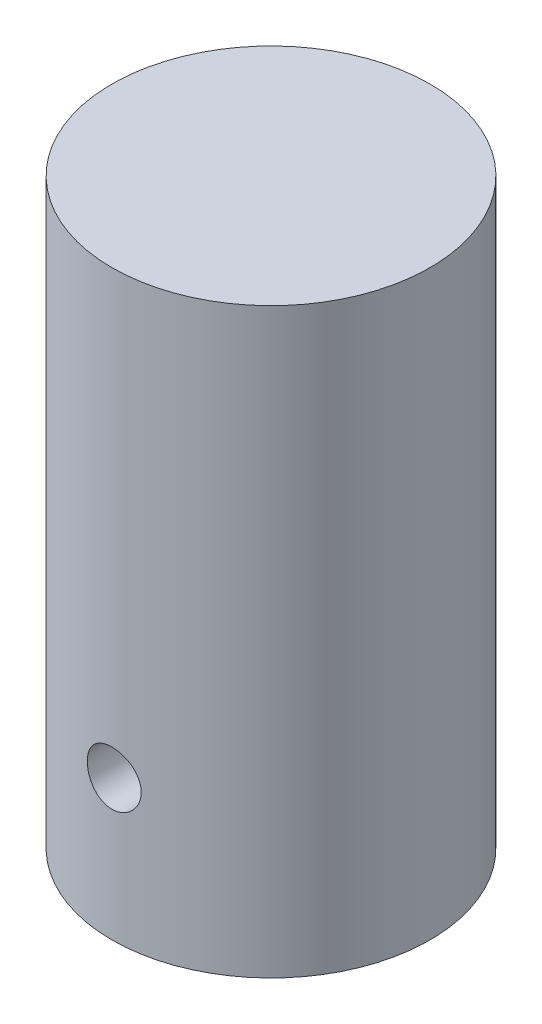
ISO-10303-21;
HEADER;
FILE_DESCRIPTION(('STEP AP214'),'2;1');
FILE_NAME('part.step','',(''),(''),'','','');
FILE_SCHEMA(('AUTOMOTIVE_DESIGN { 1 0 10303 214 1 1 1 1 }'));
ENDSEC;
DATA;
#1=APPLICATION_CONTEXT('core data for automotive mechanical design processes');
#2=APPLICATION_PROTOCOL_DEFINITION('international standard','automotive_design',2000,#1);
#3=PRODUCT_CONTEXT('',#1,'mechanical');
#4=PRODUCT('Part','Part','',(#3));
#5=PRODUCT_RELATED_PRODUCT_CATEGORY('part','',(#4));
#6=PRODUCT_DEFINITION_FORMATION('','',#4);
#7=PRODUCT_DEFINITION_CONTEXT('part definition',#1,'design');
#8=PRODUCT_DEFINITION('design','',#6,#7);
#9=PRODUCT_DEFINITION_SHAPE('','',#8);
#10=(LENGTH_UNIT() NAMED_UNIT(*) SI_UNIT(.MILLI.,.METRE.));
#11=(NAMED_UNIT(*) PLANE_ANGLE_UNIT() SI_UNIT($,.RADIAN.));
#12=(NAMED_UNIT(*) SI_UNIT($,.STERADIAN.) SOLID_ANGLE_UNIT());
#13=UNCERTAINTY_MEASURE_WITH_UNIT(LENGTH_MEASURE(1.E-05),#10,'distance_accuracy_value','');
#14=(GEOMETRIC_REPRESENTATION_CONTEXT(3) GLOBAL_UNCERTAINTY_ASSIGNED_CONTEXT((#13)) GLOBAL_UNIT_ASSIGNED_CONTEXT((#10,
#11,#12)) REPRESENTATION_CONTEXT('',''));
#15=CARTESIAN_POINT('',(0.,0.,0.));
#16=DIRECTION('',(0.,0.,1.));
#17=DIRECTION('',(1.,0.,0.));
#18=AXIS2_PLACEMENT_3D('',#15,#16,#17);
#19=CARTESIAN_POINT('',(0.,137.16,0.));
#20=DIRECTION('',(0.,-1.,0.));
#21=DIRECTION('',(0.,0.,-1.));
#22=AXIS2_PLACEMENT_3D('',#19,#20,#21);
#23=CYLINDRICAL_SURFACE('',#22,37.465);
#24=CARTESIAN_POINT('',(6.35,33.02,36.9229430706708));
#25=CARTESIAN_POINT('',(6.35000279141171,32.8429779279102,36.9229417748591));
#26=CARTESIAN_POINT('',(6.34259532528094,32.6659933481382,36.924218600387));
#27=CARTESIAN_POINT('',(6.3130271330691,32.313242688087,36.9292858540445));
#28=CARTESIAN_POINT('',(6.29086351707607,32.1374768533069,36.9330767745454));
#29=CARTESIAN_POINT('',(6.23193058823662,31.7883737158959,36.9430663826917));
#30=CARTESIAN_POINT('',(6.19515215922365,31.6150379990775,36.9492665730948));
#31=CARTESIAN_POINT('',(6.10725675226593,31.2720688886345,36.9638962260846));
#32=CARTESIAN_POINT('',(6.05613450827856,31.1024368794501,36.9723265073391));
#33=CARTESIAN_POINT('',(5.94001398475862,30.7683400061689,36.9911598987731));
#34=CARTESIAN_POINT('',(5.87503283304677,30.6038690489028,37.0015605720459));
#35=CARTESIAN_POINT('',(5.73160931419481,30.2809531587946,37.024048226987));
#36=CARTESIAN_POINT('',(5.65316198508221,30.1225104736148,37.0361358299416));
#37=CARTESIAN_POINT('',(5.48342916226199,29.8128734349299,37.0616457673502));
#38=CARTESIAN_POINT('',(5.39214998328585,29.6616755649309,37.0750674443417));
#39=CARTESIAN_POINT('',(5.19733044249672,29.367411205207,37.1028794422679));
#40=CARTESIAN_POINT('',(5.09378551997719,29.2243477695128,37.1172701226382));
#41=CARTESIAN_POINT('',(4.87421779068985,28.9461597195228,37.146744116124));
#42=CARTESIAN_POINT('',(4.75809364747908,28.8111156041066,37.1618323914032));
#43=CARTESIAN_POINT('',(4.51488121897134,28.551215519359,37.1921643883722));
#44=CARTESIAN_POINT('',(4.3877888897322,28.4263633410675,37.2074081655528));
#45=CARTESIAN_POINT('',(4.12358831809976,28.1877967478572,37.2376142207968));
#46=CARTESIAN_POINT('',(3.98648315756614,28.0740789308957,37.2525765837088));
#47=CARTESIAN_POINT('',(3.70310692352254,27.858487943453,37.281812153211));
#48=CARTESIAN_POINT('',(3.55683248965142,27.7566191549295,37.2960851037118));
#49=CARTESIAN_POINT('',(3.25528646093831,27.564937093672,37.3236169600895));
#50=CARTESIAN_POINT('',(3.09996739305173,27.4751975512082,37.3368694703722));
#51=CARTESIAN_POINT('',(2.78214446136281,27.309103441585,37.3618966515687));
#52=CARTESIAN_POINT('',(2.61963794116679,27.2327538758421,37.3736707698099));
#53=CARTESIAN_POINT('',(2.28869512625808,27.0940797494783,37.3953948025334));
#54=CARTESIAN_POINT('',(2.12026136913199,27.0317492694472,37.4053454866114));
#55=CARTESIAN_POINT('',(1.77860742000097,26.9215298267097,37.4231499027759));
#56=CARTESIAN_POINT('',(1.60538550554222,26.8736461367658,37.4310028691218));
#57=CARTESIAN_POINT('',(1.08386846683103,26.7531119562433,37.4509148486679));
#58=CARTESIAN_POINT('',(0.730158725043868,26.7020912500178,37.4595677631988));
#59=CARTESIAN_POINT('',(0.0192946776186427,26.6600414383014,37.4666841086695));
#60=CARTESIAN_POINT('',(-0.337859384488475,26.669008122004,37.4651482548085));
#61=CARTESIAN_POINT('',(-1.04184938818574,26.7461584808905,37.4521482632217));
#62=CARTESIAN_POINT('',(-1.38875354291931,26.8137347170075,37.4407859717608));
#63=CARTESIAN_POINT('',(-2.06621277185894,27.0052502774216,37.4095186888445));
#64=CARTESIAN_POINT('',(-2.39676733453493,27.1291913639717,37.3896134302934));
#65=CARTESIAN_POINT('',(-3.03396211682998,27.4305133275901,37.3433249625064));
#66=CARTESIAN_POINT('',(-3.34048213700312,27.6081436009934,37.316911630219));
#67=CARTESIAN_POINT('',(-3.91959227462119,28.0116203392101,37.2605395168837));
#68=CARTESIAN_POINT('',(-4.19217955142351,28.2374708364357,37.2305804394166));
#69=CARTESIAN_POINT('',(-4.69927895714922,28.7343438510591,37.1700034224869));
#70=CARTESIAN_POINT('',(-4.93327053922575,29.0058975034978,37.1393819324612));
#71=CARTESIAN_POINT('',(-5.35245392593285,29.5846815641848,37.0812942455192));
#72=CARTESIAN_POINT('',(-5.53764525006624,29.8919123236743,37.0538280796725));
#73=CARTESIAN_POINT('',(-5.85407953710823,30.5339442406,37.0051585911984));
#74=CARTESIAN_POINT('',(-5.98525815710648,30.8687777135642,36.9839627465329));
#75=CARTESIAN_POINT('',(-6.18936206426045,31.556167311694,36.9503562312994));
#76=CARTESIAN_POINT('',(-6.26229266738911,31.9087218164371,36.9379447590422));
#77=CARTESIAN_POINT('',(-6.34709384460755,32.6168835055322,36.9234678421246));
#78=CARTESIAN_POINT('',(-6.35970721768158,32.9723992502977,36.9212765456527));
#79=CARTESIAN_POINT('',(-6.32549683373919,33.6804613982254,36.9271526737609));
#80=CARTESIAN_POINT('',(-6.27867545446003,34.0330079196058,36.9352196879487));
#81=CARTESIAN_POINT('',(-6.12755856328144,34.7227539742049,36.9605870866626));
#82=CARTESIAN_POINT('',(-6.02364259931066,35.0600391050828,36.9778264723004));
#83=CARTESIAN_POINT('',(-5.76168490296192,35.7124080067798,37.0195448040393));
#84=CARTESIAN_POINT('',(-5.60363983348741,36.0274904073409,37.0440241964792));
#85=CARTESIAN_POINT('',(-5.23616310891025,36.629811414514,37.0977560143979));
#86=CARTESIAN_POINT('',(-5.02625632334476,36.9167562145644,37.1270516831742));
#87=CARTESIAN_POINT('',(-4.56166401992295,37.4516159849238,37.1869892749972));
#88=CARTESIAN_POINT('',(-4.30697524051591,37.6995281099207,37.217631295979));
#89=CARTESIAN_POINT('',(-3.75675903815106,38.1520061184341,37.2772080912782));
#90=CARTESIAN_POINT('',(-3.46082109485541,38.3560760897849,37.3061209088732));
#91=CARTESIAN_POINT('',(-2.83841657324286,38.7115984068522,37.3586264947807));
#92=CARTESIAN_POINT('',(-2.51195100873063,38.8630524991246,37.3822194396744));
#93=CARTESIAN_POINT('',(-1.83928606066535,39.1082817900893,37.421334207005));
#94=CARTESIAN_POINT('',(-1.49318246426714,39.2023144056904,37.4368920013525));
#95=CARTESIAN_POINT('',(-0.789612381808284,39.33083762764,37.4583264559331));
#96=CARTESIAN_POINT('',(-0.432146866718389,39.365333308058,37.4642039411742));
#97=CARTESIAN_POINT('',(0.101984465339868,39.3716501433896,37.4652822069458));
#98=CARTESIAN_POINT('',(0.278660824538074,39.3663448034955,37.4643792461815));
#99=CARTESIAN_POINT('',(0.630910248375709,39.3410416873006,37.4600999348255));
#100=CARTESIAN_POINT('',(0.806483702727598,39.3210494338571,37.4567245139773));
#101=CARTESIAN_POINT('',(1.15534231245424,39.2665096396473,37.4475887044141));
#102=CARTESIAN_POINT('',(1.32862663390469,39.2319569375789,37.4418274700023));
#103=CARTESIAN_POINT('',(1.67157269701813,39.1485780582277,37.4280844037534));
#104=CARTESIAN_POINT('',(1.84123571960936,39.0997570208375,37.4201033716055));
#105=CARTESIAN_POINT('',(2.17567198668656,38.9882491419048,37.4021483486495));
#106=CARTESIAN_POINT('',(2.34044923358439,38.925574026656,37.3921760439695));
#107=CARTESIAN_POINT('',(2.66407136469494,38.7868196261229,37.3705130033313));
#108=CARTESIAN_POINT('',(2.82291834908299,38.7107451418,37.3588228831101));
#109=CARTESIAN_POINT('',(3.13372361602806,38.5456899649814,37.3340369935162));
#110=CARTESIAN_POINT('',(3.28567916728831,38.4567042130054,37.3209406736277));
#111=CARTESIAN_POINT('',(3.58156051285462,38.266507812355,37.2937088207987));
#112=CARTESIAN_POINT('',(3.72548910131004,38.1653014569379,37.2795736534978));
#113=CARTESIAN_POINT('',(4.0061175405423,37.9500279829882,37.2504683547157));
#114=CARTESIAN_POINT('',(4.14270774436708,37.8358189937871,37.2354901389976));
#115=CARTESIAN_POINT('',(4.40575720486539,37.5963983703591,37.2052826069384));
#116=CARTESIAN_POINT('',(4.53222005739372,37.4711906747823,37.1900533820582));
#117=CARTESIAN_POINT('',(4.77427711512344,37.2105169336016,37.1597550265217));
#118=CARTESIAN_POINT('',(4.8898647624007,37.0750447861258,37.1446859972621));
#119=CARTESIAN_POINT('',(5.10924511026963,36.7948850831837,37.1151463601762));
#120=CARTESIAN_POINT('',(5.21304214336571,36.6502009433935,37.1006755337894));
#121=CARTESIAN_POINT('',(5.40891750548063,36.3514062770834,37.0726274388618));
#122=CARTESIAN_POINT('',(5.50089893076861,36.1972314673241,37.0590579519227));
#123=CARTESIAN_POINT('',(5.67149208696553,35.8816160179082,37.0333342280351));
#124=CARTESIAN_POINT('',(5.75010873763827,35.720178079709,37.0211794708262));
#125=CARTESIAN_POINT('',(5.89338024297566,35.3912284690086,36.9986426334629));
#126=CARTESIAN_POINT('',(5.95804473056657,35.2237210809342,36.9882593312945));
#127=CARTESIAN_POINT('',(6.0729737087923,34.8837837201648,36.9695630766091));
#128=CARTESIAN_POINT('',(6.1232412714356,34.7113548062705,36.9612496824657));
#129=CARTESIAN_POINT('',(6.22707453855869,34.2892845729493,36.9439259134538));
#130=CARTESIAN_POINT('',(6.27311607180392,34.037703905521,36.9360961033579));
#131=CARTESIAN_POINT('',(6.3345764955392,33.530722778203,36.9256056660701));
#132=CARTESIAN_POINT('',(6.34999597389238,33.2753223917367,36.9229449396454));
#133=CARTESIAN_POINT('',(6.35,33.02,36.9229430706708));
#134=B_SPLINE_CURVE_WITH_KNOTS('',3,(#24,#25,#26,#27,#28,#29,#30,#31,#32,#33,#34,#35,#36,#37,
#38,#39,#40,#41,#42,#43,#44,#45,#46,#47,#48,#49,#50,#51,#52,#53,#54,#55,#56,#57,#58,#59,#60,#61,
#62,#63,#64,#65,#66,#67,#68,#69,#70,#71,#72,#73,#74,#75,#76,#77,#78,#79,#80,#81,#82,#83,#84,#85,
#86,#87,#88,#89,#90,#91,#92,#93,#94,#95,#96,#97,#98,#99,#100,#101,#102,#103,#104,#105,#106,#107,
#108,#109,#110,#111,#112,#113,#114,#115,#116,#117,#118,#119,#120,#121,#122,#123,#124,#125,#126,
#127,#128,#129,#130,#131,#132,#133),.UNSPECIFIED.,.T.,.F.,(4,2,2,2,2,2,2,2,2,2,2,2,2,2,2,2,2,2,
2,2,2,2,2,2,2,2,2,2,2,2,2,2,2,2,2,2,2,2,2,2,2,2,2,2,2,2,2,2,2,2,2,2,2,2,4),(0.,
0.530842262782578,1.06178851873756,1.59306648002144,2.12453974509419,2.65535994507213,
3.18637616143376,3.71713196622598,4.24808574227657,4.783689476758,5.31949153759851,
5.85512937282706,6.39096466978,6.92992324743332,7.46908270980697,8.00801408863623,
8.54714192834565,9.61394141379653,10.6806660161912,11.7364652602675,12.7922975162911,
13.853111719601,14.9140146681803,15.9882265295015,17.0624489673338,18.1379474014621,
19.2133476696029,20.2754698080297,21.337549456706,22.3926526711854,23.4478209452153,
24.5130399581971,25.5783365850975,26.6551133948241,27.7318544581056,28.8037324268096,
29.8755190395879,30.4052775528997,30.9348369580735,31.4645842364605,31.9941409183267,
32.5232510804091,33.0521720478237,33.5813008437124,34.1102442876548,34.6456425169921,
35.1808497951281,35.7163777706954,36.2517083235993,36.7911816411863,37.3304559389128,
37.8693567080755,38.408142401051,39.1738012625574,39.9394454252798),.UNSPECIFIED.);
#135=CARTESIAN_POINT('',(6.35,33.02,36.9229430706708));
#136=VERTEX_POINT('',#135);
#137=EDGE_CURVE('E10',#136,#136,#134,.T.);
#138=ORIENTED_EDGE('',*,*,#137,.T.);
#139=EDGE_LOOP('',(#138));
#140=FACE_BOUND('',#139,.T.);
#141=CARTESIAN_POINT('',(0.,137.16,0.));
#142=DIRECTION('',(0.,1.,0.));
#143=DIRECTION('',(0.,0.,1.));
#144=AXIS2_PLACEMENT_3D('',#141,#142,#143);
#145=CIRCLE('',#144,37.465);
#146=CARTESIAN_POINT('',(0.,137.16,37.465));
#147=VERTEX_POINT('',#146);
#148=EDGE_CURVE('E46',#147,#147,#145,.T.);
#149=ORIENTED_EDGE('',*,*,#148,.F.);
#150=EDGE_LOOP('',(#149));
#151=FACE_BOUND('',#150,.T.);
#152=CARTESIAN_POINT('',(0.,0.,0.));
#153=DIRECTION('',(0.,1.,0.));
#154=DIRECTION('',(0.,0.,1.));
#155=AXIS2_PLACEMENT_3D('',#152,#153,#154);
#156=CIRCLE('',#155,37.465);
#157=CARTESIAN_POINT('',(0.,0.,37.465));
#158=VERTEX_POINT('',#157);
#159=EDGE_CURVE('E50',#158,#158,#156,.T.);
#160=ORIENTED_EDGE('',*,*,#159,.T.);
#161=EDGE_LOOP('',(#160));
#162=FACE_BOUND('',#161,.T.);
#163=ADVANCED_FACE('F35',(#140,#151,#162),#23,.T.);
#164=CARTESIAN_POINT('',(0.,137.16,0.));
#165=DIRECTION('',(0.,1.,0.));
#166=DIRECTION('',(0.,0.,1.));
#167=AXIS2_PLACEMENT_3D('',#164,#165,#166);
#168=PLANE('',#167);
#169=ORIENTED_EDGE('',*,*,#148,.T.);
#170=EDGE_LOOP('',(#169));
#171=FACE_BOUND('',#170,.T.);
#172=ADVANCED_FACE('F79',(#171),#168,.T.);
#173=CARTESIAN_POINT('',(0.,0.,0.));
#174=DIRECTION('',(0.,1.,0.));
#175=DIRECTION('',(0.,0.,1.));
#176=AXIS2_PLACEMENT_3D('',#173,#174,#175);
#177=PLANE('',#176);
#178=CARTESIAN_POINT('',(0.,0.,0.));
#179=DIRECTION('',(0.,-1.,0.));
#180=DIRECTION('',(0.,0.,-1.));
#181=AXIS2_PLACEMENT_3D('',#178,#179,#180);
#182=CIRCLE('',#181,6.35);
#183=CARTESIAN_POINT('',(0.,0.,-6.35));
#184=VERTEX_POINT('',#183);
#185=EDGE_CURVE('E60',#184,#184,#182,.T.);
#186=ORIENTED_EDGE('',*,*,#185,.F.);
#187=EDGE_LOOP('',(#186));
#188=FACE_BOUND('',#187,.T.);
#189=ORIENTED_EDGE('',*,*,#159,.F.);
#190=EDGE_LOOP('',(#189));
#191=FACE_BOUND('',#190,.T.);
#192=ADVANCED_FACE('F75',(#188,#191),#177,.F.);
#193=CARTESIAN_POINT('',(0.,33.02,18.415));
#194=DIRECTION('',(0.,0.,1.));
#195=DIRECTION('',(1.,0.,0.));
#196=AXIS2_PLACEMENT_3D('',#193,#194,#195);
#197=CYLINDRICAL_SURFACE('',#196,6.35);
#198=CARTESIAN_POINT('',(0.,33.02,18.415));
#199=DIRECTION('',(0.,0.,1.));
#200=DIRECTION('',(1.,0.,0.));
#201=AXIS2_PLACEMENT_3D('',#198,#199,#200);
#202=CIRCLE('',#201,6.35);
#203=CARTESIAN_POINT('',(6.35,33.02,18.415));
#204=VERTEX_POINT('',#203);
#205=EDGE_CURVE('E55',#204,#204,#202,.T.);
#206=ORIENTED_EDGE('',*,*,#205,.F.);
#207=EDGE_LOOP('',(#206));
#208=FACE_BOUND('',#207,.T.);
#209=ORIENTED_EDGE('',*,*,#137,.F.);
#210=EDGE_LOOP('',(#209));
#211=FACE_BOUND('',#210,.T.);
#212=ADVANCED_FACE('F78',(#208,#211),#197,.F.);
#213=CARTESIAN_POINT('',(0.,33.02,18.415));
#214=DIRECTION('',(0.,0.,1.));
#215=DIRECTION('',(1.,0.,0.));
#216=AXIS2_PLACEMENT_3D('',#213,#214,#215);
#217=PLANE('',#216);
#218=ORIENTED_EDGE('',*,*,#205,.T.);
#219=EDGE_LOOP('',(#218));
#220=FACE_BOUND('',#219,.T.);
#221=ADVANCED_FACE('F71',(#220),#217,.T.);
#222=CARTESIAN_POINT('',(0.,19.05,0.));
#223=DIRECTION('',(0.,-1.,0.));
#224=DIRECTION('',(0.,0.,-1.));
#225=AXIS2_PLACEMENT_3D('',#222,#223,#224);
#226=CYLINDRICAL_SURFACE('',#225,6.35);
#227=CARTESIAN_POINT('',(0.,19.05,0.));
#228=DIRECTION('',(0.,-1.,0.));
#229=DIRECTION('',(0.,0.,-1.));
#230=AXIS2_PLACEMENT_3D('',#227,#228,#229);
#231=CIRCLE('',#230,6.35);
#232=CARTESIAN_POINT('',(0.,19.05,-6.35));
#233=VERTEX_POINT('',#232);
#234=EDGE_CURVE('E59',#233,#233,#231,.T.);
#235=ORIENTED_EDGE('',*,*,#234,.F.);
#236=EDGE_LOOP('',(#235));
#237=FACE_BOUND('',#236,.T.);
#238=ORIENTED_EDGE('',*,*,#185,.T.);
#239=EDGE_LOOP('',(#238));
#240=FACE_BOUND('',#239,.T.);
#241=ADVANCED_FACE('F68',(#237,#240),#226,.F.);
#242=CARTESIAN_POINT('',(0.,19.05,0.));
#243=DIRECTION('',(0.,-1.,0.));
#244=DIRECTION('',(0.,0.,-1.));
#245=AXIS2_PLACEMENT_3D('',#242,#243,#244);
#246=PLANE('',#245);
#247=ORIENTED_EDGE('',*,*,#234,.T.);
#248=EDGE_LOOP('',(#247));
#249=FACE_BOUND('',#248,.T.);
#250=ADVANCED_FACE('F66',(#249),#246,.T.);
#251=CLOSED_SHELL('',(#163,#172,#192,#212,#221,#241,#250));
#252=MANIFOLD_SOLID_BREP('B2',#251);
#253=ADVANCED_BREP_SHAPE_REPRESENTATION('',(#18,#252),#14);
#254=SHAPE_DEFINITION_REPRESENTATION(#9,#253);
ENDSEC;
END-ISO-10303-21;
